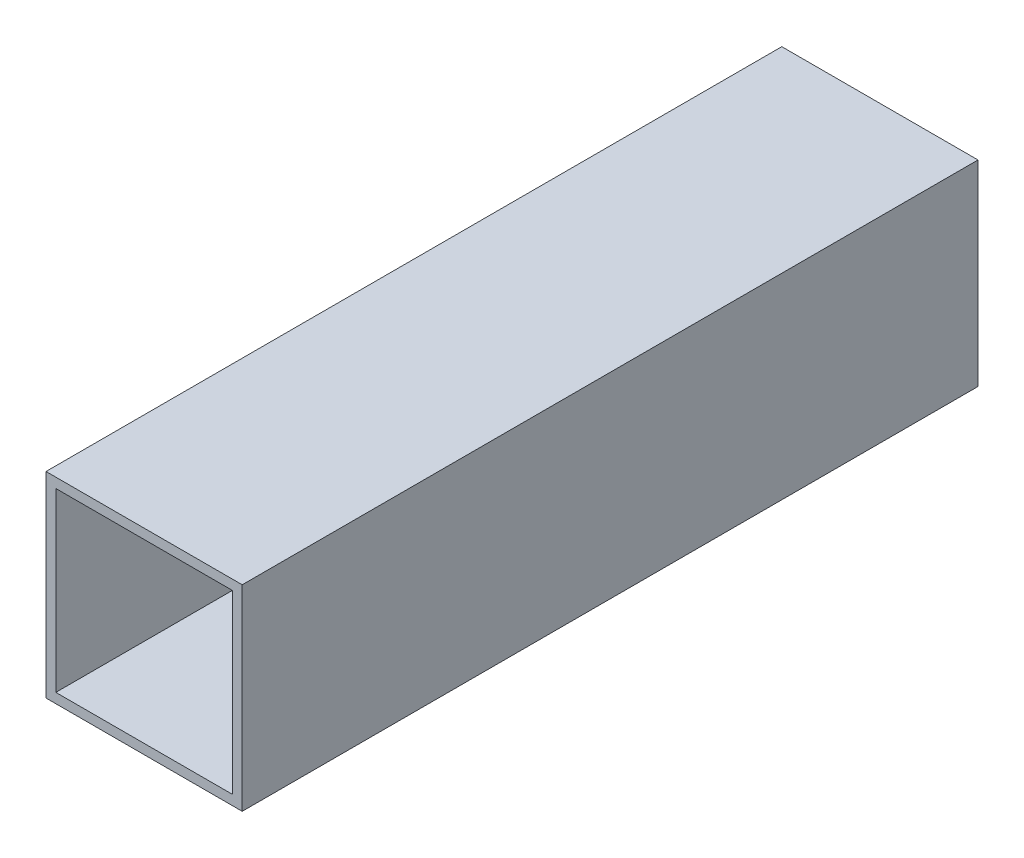
ISO-10303-21;
HEADER;
FILE_DESCRIPTION(('STEP AP214'),'2;1');
FILE_NAME('part.step','',(''),(''),'','','');
FILE_SCHEMA(('AUTOMOTIVE_DESIGN { 1 0 10303 214 1 1 1 1 }'));
ENDSEC;
DATA;
#1=APPLICATION_CONTEXT('core data for automotive mechanical design processes');
#2=APPLICATION_PROTOCOL_DEFINITION('international standard','automotive_design',2000,#1);
#3=PRODUCT_CONTEXT('',#1,'mechanical');
#4=PRODUCT('Part','Part','',(#3));
#5=PRODUCT_RELATED_PRODUCT_CATEGORY('part','',(#4));
#6=PRODUCT_DEFINITION_FORMATION('','',#4);
#7=PRODUCT_DEFINITION_CONTEXT('part definition',#1,'design');
#8=PRODUCT_DEFINITION('design','',#6,#7);
#9=PRODUCT_DEFINITION_SHAPE('','',#8);
#10=(LENGTH_UNIT() NAMED_UNIT(*) SI_UNIT(.MILLI.,.METRE.));
#11=(NAMED_UNIT(*) PLANE_ANGLE_UNIT() SI_UNIT($,.RADIAN.));
#12=(NAMED_UNIT(*) SI_UNIT($,.STERADIAN.) SOLID_ANGLE_UNIT());
#13=UNCERTAINTY_MEASURE_WITH_UNIT(LENGTH_MEASURE(1.E-05),#10,'distance_accuracy_value','');
#14=(GEOMETRIC_REPRESENTATION_CONTEXT(3) GLOBAL_UNCERTAINTY_ASSIGNED_CONTEXT((#13)) GLOBAL_UNIT_ASSIGNED_CONTEXT((#10,
#11,#12)) REPRESENTATION_CONTEXT('',''));
#15=CARTESIAN_POINT('',(0.,0.,0.));
#16=DIRECTION('',(0.,0.,1.));
#17=DIRECTION('',(1.,0.,0.));
#18=AXIS2_PLACEMENT_3D('',#15,#16,#17);
#19=CARTESIAN_POINT('',(0.,0.,187.5));
#20=DIRECTION('',(0.,0.,-1.));
#21=DIRECTION('',(-1.,0.,0.));
#22=AXIS2_PLACEMENT_3D('',#19,#20,#21);
#23=PLANE('',#22);
#24=DIRECTION('',(0.,-1.,0.));
#25=VECTOR('',#24,1.);
#26=CARTESIAN_POINT('',(-50.,-50.,187.5));
#27=LINE('',#26,#25);
#28=CARTESIAN_POINT('',(-50.,49.9999999999999,187.5));
#29=VERTEX_POINT('',#28);
#30=CARTESIAN_POINT('',(-50.,-50.,187.5));
#31=VERTEX_POINT('',#30);
#32=EDGE_CURVE('E134',#29,#31,#27,.T.);
#33=ORIENTED_EDGE('',*,*,#32,.T.);
#34=DIRECTION('',(1.,0.,0.));
#35=VECTOR('',#34,1.);
#36=CARTESIAN_POINT('',(-50.,-50.,187.5));
#37=LINE('',#36,#35);
#38=CARTESIAN_POINT('',(50.,-50.,187.5));
#39=VERTEX_POINT('',#38);
#40=EDGE_CURVE('E137',#31,#39,#37,.T.);
#41=ORIENTED_EDGE('',*,*,#40,.T.);
#42=DIRECTION('',(0.,1.,0.));
#43=VECTOR('',#42,1.);
#44=CARTESIAN_POINT('',(50.,-50.,187.5));
#45=LINE('',#44,#43);
#46=CARTESIAN_POINT('',(49.9999999999999,49.9999999999999,187.5));
#47=VERTEX_POINT('',#46);
#48=EDGE_CURVE('E140',#39,#47,#45,.T.);
#49=ORIENTED_EDGE('',*,*,#48,.T.);
#50=DIRECTION('',(-1.,0.,0.));
#51=VECTOR('',#50,1.);
#52=CARTESIAN_POINT('',(-50.,49.9999999999999,187.5));
#53=LINE('',#52,#51);
#54=EDGE_CURVE('E142',#47,#29,#53,.T.);
#55=ORIENTED_EDGE('',*,*,#54,.T.);
#56=EDGE_LOOP('',(#33,#41,#49,#55));
#57=FACE_BOUND('',#56,.T.);
#58=DIRECTION('',(0.,-1.,0.));
#59=VECTOR('',#58,1.);
#60=CARTESIAN_POINT('',(-45.,-45.,187.5));
#61=LINE('',#60,#59);
#62=CARTESIAN_POINT('',(-45.,44.9999999999999,187.5));
#63=VERTEX_POINT('',#62);
#64=CARTESIAN_POINT('',(-45.,-45.,187.5));
#65=VERTEX_POINT('',#64);
#66=EDGE_CURVE('E98',#63,#65,#61,.T.);
#67=ORIENTED_EDGE('',*,*,#66,.F.);
#68=DIRECTION('',(-1.,0.,0.));
#69=VECTOR('',#68,1.);
#70=CARTESIAN_POINT('',(-45.,44.9999999999999,187.5));
#71=LINE('',#70,#69);
#72=CARTESIAN_POINT('',(45.,44.9999999999999,187.5));
#73=VERTEX_POINT('',#72);
#74=EDGE_CURVE('E120',#73,#63,#71,.T.);
#75=ORIENTED_EDGE('',*,*,#74,.F.);
#76=DIRECTION('',(0.,1.,0.));
#77=VECTOR('',#76,1.);
#78=CARTESIAN_POINT('',(45.,-45.,187.5));
#79=LINE('',#78,#77);
#80=CARTESIAN_POINT('',(45.,-45.,187.5));
#81=VERTEX_POINT('',#80);
#82=EDGE_CURVE('E118',#81,#73,#79,.T.);
#83=ORIENTED_EDGE('',*,*,#82,.F.);
#84=DIRECTION('',(1.,0.,0.));
#85=VECTOR('',#84,1.);
#86=CARTESIAN_POINT('',(-45.,-45.,187.5));
#87=LINE('',#86,#85);
#88=EDGE_CURVE('E106',#65,#81,#87,.T.);
#89=ORIENTED_EDGE('',*,*,#88,.F.);
#90=EDGE_LOOP('',(#67,#75,#83,#89));
#91=FACE_BOUND('',#90,.T.);
#92=ADVANCED_FACE('F33',(#57,#91),#23,.F.);
#93=CARTESIAN_POINT('',(0.,0.,-187.5));
#94=DIRECTION('',(0.,0.,-1.));
#95=DIRECTION('',(-1.,0.,0.));
#96=AXIS2_PLACEMENT_3D('',#93,#94,#95);
#97=PLANE('',#96);
#98=DIRECTION('',(0.,-1.,0.));
#99=VECTOR('',#98,1.);
#100=CARTESIAN_POINT('',(-50.,-50.,-187.5));
#101=LINE('',#100,#99);
#102=CARTESIAN_POINT('',(-50.,49.9999999999999,-187.5));
#103=VERTEX_POINT('',#102);
#104=CARTESIAN_POINT('',(-50.,-50.,-187.5));
#105=VERTEX_POINT('',#104);
#106=EDGE_CURVE('E114',#103,#105,#101,.T.);
#107=ORIENTED_EDGE('',*,*,#106,.F.);
#108=DIRECTION('',(-1.,0.,0.));
#109=VECTOR('',#108,1.);
#110=CARTESIAN_POINT('',(-50.,49.9999999999999,-187.5));
#111=LINE('',#110,#109);
#112=CARTESIAN_POINT('',(49.9999999999999,49.9999999999999,-187.5));
#113=VERTEX_POINT('',#112);
#114=EDGE_CURVE('E138',#113,#103,#111,.T.);
#115=ORIENTED_EDGE('',*,*,#114,.F.);
#116=DIRECTION('',(0.,1.,0.));
#117=VECTOR('',#116,1.);
#118=CARTESIAN_POINT('',(50.,-50.,-187.5));
#119=LINE('',#118,#117);
#120=CARTESIAN_POINT('',(50.,-50.,-187.5));
#121=VERTEX_POINT('',#120);
#122=EDGE_CURVE('E149',#121,#113,#119,.T.);
#123=ORIENTED_EDGE('',*,*,#122,.F.);
#124=DIRECTION('',(1.,0.,0.));
#125=VECTOR('',#124,1.);
#126=CARTESIAN_POINT('',(-50.,-50.,-187.5));
#127=LINE('',#126,#125);
#128=EDGE_CURVE('E147',#105,#121,#127,.T.);
#129=ORIENTED_EDGE('',*,*,#128,.F.);
#130=EDGE_LOOP('',(#107,#115,#123,#129));
#131=FACE_BOUND('',#130,.T.);
#132=DIRECTION('',(-1.,0.,0.));
#133=VECTOR('',#132,1.);
#134=CARTESIAN_POINT('',(-45.,44.9999999999999,-187.5));
#135=LINE('',#134,#133);
#136=CARTESIAN_POINT('',(45.,44.9999999999999,-187.5));
#137=VERTEX_POINT('',#136);
#138=CARTESIAN_POINT('',(-45.,44.9999999999999,-187.5));
#139=VERTEX_POINT('',#138);
#140=EDGE_CURVE('E107',#137,#139,#135,.T.);
#141=ORIENTED_EDGE('',*,*,#140,.T.);
#142=DIRECTION('',(0.,-1.,0.));
#143=VECTOR('',#142,1.);
#144=CARTESIAN_POINT('',(-45.,-45.,-187.5));
#145=LINE('',#144,#143);
#146=CARTESIAN_POINT('',(-45.,-45.,-187.5));
#147=VERTEX_POINT('',#146);
#148=EDGE_CURVE('E56',#139,#147,#145,.T.);
#149=ORIENTED_EDGE('',*,*,#148,.T.);
#150=DIRECTION('',(1.,0.,0.));
#151=VECTOR('',#150,1.);
#152=CARTESIAN_POINT('',(-45.,-45.,-187.5));
#153=LINE('',#152,#151);
#154=CARTESIAN_POINT('',(45.,-45.,-187.5));
#155=VERTEX_POINT('',#154);
#156=EDGE_CURVE('E113',#147,#155,#153,.T.);
#157=ORIENTED_EDGE('',*,*,#156,.T.);
#158=DIRECTION('',(0.,1.,0.));
#159=VECTOR('',#158,1.);
#160=CARTESIAN_POINT('',(45.,-45.,-187.5));
#161=LINE('',#160,#159);
#162=EDGE_CURVE('E126',#155,#137,#161,.T.);
#163=ORIENTED_EDGE('',*,*,#162,.T.);
#164=EDGE_LOOP('',(#141,#149,#157,#163));
#165=FACE_BOUND('',#164,.T.);
#166=ADVANCED_FACE('F167',(#131,#165),#97,.T.);
#167=CARTESIAN_POINT('',(-50.,-50.,187.5));
#168=DIRECTION('',(1.,0.,0.));
#169=DIRECTION('',(0.,0.,-1.));
#170=AXIS2_PLACEMENT_3D('',#167,#168,#169);
#171=PLANE('',#170);
#172=ORIENTED_EDGE('',*,*,#106,.T.);
#173=DIRECTION('',(0.,0.,-1.));
#174=VECTOR('',#173,1.);
#175=CARTESIAN_POINT('',(-50.,-50.,187.5));
#176=LINE('',#175,#174);
#177=EDGE_CURVE('E11',#31,#105,#176,.T.);
#178=ORIENTED_EDGE('',*,*,#177,.F.);
#179=ORIENTED_EDGE('',*,*,#32,.F.);
#180=DIRECTION('',(0.,0.,-1.));
#181=VECTOR('',#180,1.);
#182=CARTESIAN_POINT('',(-50.,49.9999999999999,187.5));
#183=LINE('',#182,#181);
#184=EDGE_CURVE('E144',#29,#103,#183,.T.);
#185=ORIENTED_EDGE('',*,*,#184,.T.);
#186=EDGE_LOOP('',(#172,#178,#179,#185));
#187=FACE_BOUND('',#186,.T.);
#188=ADVANCED_FACE('F35',(#187),#171,.F.);
#189=CARTESIAN_POINT('',(-50.,-50.,187.5));
#190=DIRECTION('',(0.,1.,0.));
#191=DIRECTION('',(0.,0.,1.));
#192=AXIS2_PLACEMENT_3D('',#189,#190,#191);
#193=PLANE('',#192);
#194=ORIENTED_EDGE('',*,*,#128,.T.);
#195=DIRECTION('',(0.,0.,-1.));
#196=VECTOR('',#195,1.);
#197=CARTESIAN_POINT('',(50.,-50.,187.5));
#198=LINE('',#197,#196);
#199=EDGE_CURVE('E41',#39,#121,#198,.T.);
#200=ORIENTED_EDGE('',*,*,#199,.F.);
#201=ORIENTED_EDGE('',*,*,#40,.F.);
#202=ORIENTED_EDGE('',*,*,#177,.T.);
#203=EDGE_LOOP('',(#194,#200,#201,#202));
#204=FACE_BOUND('',#203,.T.);
#205=ADVANCED_FACE('F177',(#204),#193,.F.);
#206=CARTESIAN_POINT('',(50.,-50.,187.5));
#207=DIRECTION('',(-1.,0.,0.));
#208=DIRECTION('',(0.,-1.,0.));
#209=AXIS2_PLACEMENT_3D('',#206,#207,#208);
#210=PLANE('',#209);
#211=ORIENTED_EDGE('',*,*,#122,.T.);
#212=DIRECTION('',(0.,0.,-1.));
#213=VECTOR('',#212,1.);
#214=CARTESIAN_POINT('',(49.9999999999999,49.9999999999999,187.5));
#215=LINE('',#214,#213);
#216=EDGE_CURVE('E154',#47,#113,#215,.T.);
#217=ORIENTED_EDGE('',*,*,#216,.F.);
#218=ORIENTED_EDGE('',*,*,#48,.F.);
#219=ORIENTED_EDGE('',*,*,#199,.T.);
#220=EDGE_LOOP('',(#211,#217,#218,#219));
#221=FACE_BOUND('',#220,.T.);
#222=ADVANCED_FACE('F161',(#221),#210,.F.);
#223=CARTESIAN_POINT('',(-50.,49.9999999999999,187.5));
#224=DIRECTION('',(0.,-1.,0.));
#225=DIRECTION('',(0.,0.,-1.));
#226=AXIS2_PLACEMENT_3D('',#223,#224,#225);
#227=PLANE('',#226);
#228=ORIENTED_EDGE('',*,*,#114,.T.);
#229=ORIENTED_EDGE('',*,*,#184,.F.);
#230=ORIENTED_EDGE('',*,*,#54,.F.);
#231=ORIENTED_EDGE('',*,*,#216,.T.);
#232=EDGE_LOOP('',(#228,#229,#230,#231));
#233=FACE_BOUND('',#232,.T.);
#234=ADVANCED_FACE('F171',(#233),#227,.F.);
#235=CARTESIAN_POINT('',(-45.,-45.,187.5));
#236=DIRECTION('',(1.,0.,0.));
#237=DIRECTION('',(0.,0.,-1.));
#238=AXIS2_PLACEMENT_3D('',#235,#236,#237);
#239=PLANE('',#238);
#240=ORIENTED_EDGE('',*,*,#148,.F.);
#241=DIRECTION('',(0.,0.,-1.));
#242=VECTOR('',#241,1.);
#243=CARTESIAN_POINT('',(-45.,44.9999999999999,187.5));
#244=LINE('',#243,#242);
#245=EDGE_CURVE('E102',#63,#139,#244,.T.);
#246=ORIENTED_EDGE('',*,*,#245,.F.);
#247=ORIENTED_EDGE('',*,*,#66,.T.);
#248=DIRECTION('',(0.,0.,-1.));
#249=VECTOR('',#248,1.);
#250=CARTESIAN_POINT('',(-45.,-45.,187.5));
#251=LINE('',#250,#249);
#252=EDGE_CURVE('E101',#65,#147,#251,.T.);
#253=ORIENTED_EDGE('',*,*,#252,.T.);
#254=EDGE_LOOP('',(#240,#246,#247,#253));
#255=FACE_BOUND('',#254,.T.);
#256=ADVANCED_FACE('F100',(#255),#239,.T.);
#257=CARTESIAN_POINT('',(-45.,-45.,187.5));
#258=DIRECTION('',(0.,1.,0.));
#259=DIRECTION('',(0.,0.,1.));
#260=AXIS2_PLACEMENT_3D('',#257,#258,#259);
#261=PLANE('',#260);
#262=ORIENTED_EDGE('',*,*,#156,.F.);
#263=ORIENTED_EDGE('',*,*,#252,.F.);
#264=ORIENTED_EDGE('',*,*,#88,.T.);
#265=DIRECTION('',(0.,0.,-1.));
#266=VECTOR('',#265,1.);
#267=CARTESIAN_POINT('',(45.,-45.,187.5));
#268=LINE('',#267,#266);
#269=EDGE_CURVE('E115',#81,#155,#268,.T.);
#270=ORIENTED_EDGE('',*,*,#269,.T.);
#271=EDGE_LOOP('',(#262,#263,#264,#270));
#272=FACE_BOUND('',#271,.T.);
#273=ADVANCED_FACE('F110',(#272),#261,.T.);
#274=CARTESIAN_POINT('',(45.,-45.,187.5));
#275=DIRECTION('',(-1.,0.,0.));
#276=DIRECTION('',(0.,-1.,0.));
#277=AXIS2_PLACEMENT_3D('',#274,#275,#276);
#278=PLANE('',#277);
#279=ORIENTED_EDGE('',*,*,#162,.F.);
#280=ORIENTED_EDGE('',*,*,#269,.F.);
#281=ORIENTED_EDGE('',*,*,#82,.T.);
#282=DIRECTION('',(0.,0.,-1.));
#283=VECTOR('',#282,1.);
#284=CARTESIAN_POINT('',(45.,44.9999999999999,187.5));
#285=LINE('',#284,#283);
#286=EDGE_CURVE('E48',#73,#137,#285,.T.);
#287=ORIENTED_EDGE('',*,*,#286,.T.);
#288=EDGE_LOOP('',(#279,#280,#281,#287));
#289=FACE_BOUND('',#288,.T.);
#290=ADVANCED_FACE('F200',(#289),#278,.T.);
#291=CARTESIAN_POINT('',(-45.,44.9999999999999,187.5));
#292=DIRECTION('',(0.,-1.,0.));
#293=DIRECTION('',(0.,0.,-1.));
#294=AXIS2_PLACEMENT_3D('',#291,#292,#293);
#295=PLANE('',#294);
#296=ORIENTED_EDGE('',*,*,#140,.F.);
#297=ORIENTED_EDGE('',*,*,#286,.F.);
#298=ORIENTED_EDGE('',*,*,#74,.T.);
#299=ORIENTED_EDGE('',*,*,#245,.T.);
#300=EDGE_LOOP('',(#296,#297,#298,#299));
#301=FACE_BOUND('',#300,.T.);
#302=ADVANCED_FACE('F204',(#301),#295,.T.);
#303=CLOSED_SHELL('',(#92,#166,#188,#205,#222,#234,#256,#273,#290,#302));
#304=MANIFOLD_SOLID_BREP('B2',#303);
#305=ADVANCED_BREP_SHAPE_REPRESENTATION('',(#18,#304),#14);
#306=SHAPE_DEFINITION_REPRESENTATION(#9,#305);
ENDSEC;
END-ISO-10303-21;
